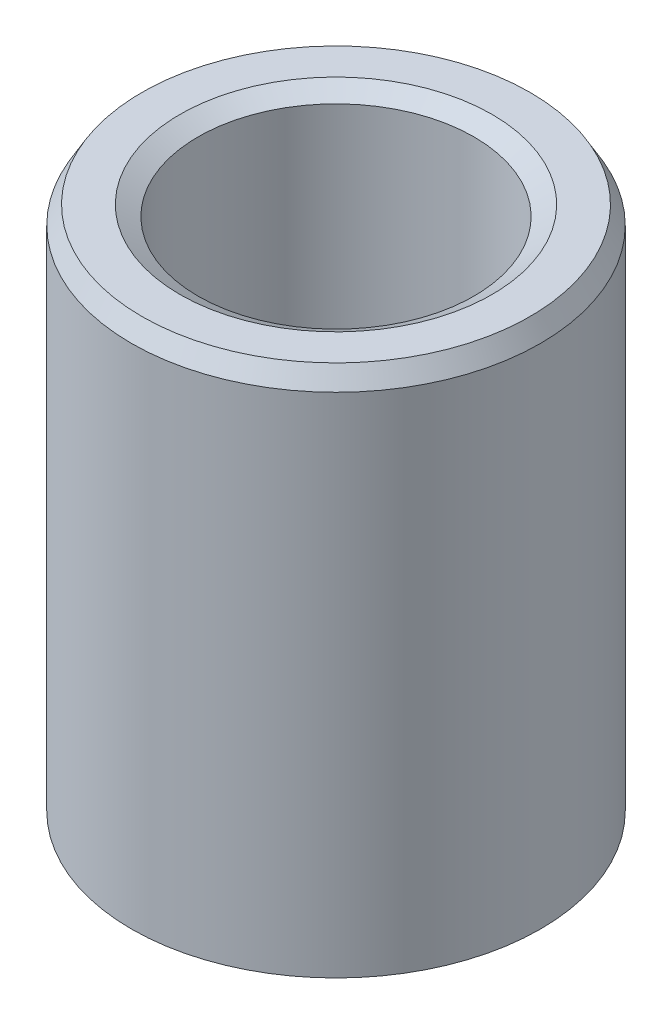
ISO-10303-21;
HEADER;
FILE_DESCRIPTION(('STEP AP214'),'2;1');
FILE_NAME('part.step','',(''),(''),'','','');
FILE_SCHEMA(('AUTOMOTIVE_DESIGN { 1 0 10303 214 1 1 1 1 }'));
ENDSEC;
DATA;
#1=APPLICATION_CONTEXT('core data for automotive mechanical design processes');
#2=APPLICATION_PROTOCOL_DEFINITION('international standard','automotive_design',2000,#1);
#3=PRODUCT_CONTEXT('',#1,'mechanical');
#4=PRODUCT('Part','Part','',(#3));
#5=PRODUCT_RELATED_PRODUCT_CATEGORY('part','',(#4));
#6=PRODUCT_DEFINITION_FORMATION('','',#4);
#7=PRODUCT_DEFINITION_CONTEXT('part definition',#1,'design');
#8=PRODUCT_DEFINITION('design','',#6,#7);
#9=PRODUCT_DEFINITION_SHAPE('','',#8);
#10=(LENGTH_UNIT() NAMED_UNIT(*) SI_UNIT(.MILLI.,.METRE.));
#11=(NAMED_UNIT(*) PLANE_ANGLE_UNIT() SI_UNIT($,.RADIAN.));
#12=(NAMED_UNIT(*) SI_UNIT($,.STERADIAN.) SOLID_ANGLE_UNIT());
#13=UNCERTAINTY_MEASURE_WITH_UNIT(LENGTH_MEASURE(1.E-05),#10,'distance_accuracy_value','');
#14=(GEOMETRIC_REPRESENTATION_CONTEXT(3) GLOBAL_UNCERTAINTY_ASSIGNED_CONTEXT((#13)) GLOBAL_UNIT_ASSIGNED_CONTEXT((#10,
#11,#12)) REPRESENTATION_CONTEXT('',''));
#15=CARTESIAN_POINT('',(0.,0.,0.));
#16=DIRECTION('',(0.,0.,1.));
#17=DIRECTION('',(1.,0.,0.));
#18=AXIS2_PLACEMENT_3D('',#15,#16,#17);
#19=CARTESIAN_POINT('',(0.,45.8368568629976,0.));
#20=DIRECTION('',(0.,-1.,0.));
#21=DIRECTION('',(0.,0.,-1.));
#22=AXIS2_PLACEMENT_3D('',#19,#20,#21);
#23=CYLINDRICAL_SURFACE('',#22,17.5);
#24=CARTESIAN_POINT('',(0.,0.892475041481128,0.));
#25=DIRECTION('',(0.,1.,0.));
#26=DIRECTION('',(0.,0.,1.));
#27=AXIS2_PLACEMENT_3D('',#24,#25,#26);
#28=CIRCLE('',#27,17.5);
#29=CARTESIAN_POINT('',(0.,0.892475041481128,17.5));
#30=VERTEX_POINT('',#29);
#31=EDGE_CURVE('E10',#30,#30,#28,.T.);
#32=ORIENTED_EDGE('',*,*,#31,.T.);
#33=EDGE_LOOP('',(#32));
#34=FACE_BOUND('',#33,.T.);
#35=CARTESIAN_POINT('',(0.,44.2910447466651,0.));
#36=DIRECTION('',(0.,1.,0.));
#37=DIRECTION('',(0.,0.,1.));
#38=AXIS2_PLACEMENT_3D('',#35,#36,#37);
#39=CIRCLE('',#38,17.5);
#40=CARTESIAN_POINT('',(0.,44.2910447466651,17.5));
#41=VERTEX_POINT('',#40);
#42=EDGE_CURVE('E50',#41,#41,#39,.F.);
#43=ORIENTED_EDGE('',*,*,#42,.T.);
#44=EDGE_LOOP('',(#43));
#45=FACE_BOUND('',#44,.T.);
#46=ADVANCED_FACE('F39',(#34,#45),#23,.T.);
#47=CARTESIAN_POINT('',(0.,45.8368568629976,0.));
#48=DIRECTION('',(0.,1.,0.));
#49=DIRECTION('',(0.,0.,1.));
#50=AXIS2_PLACEMENT_3D('',#47,#48,#49);
#51=PLANE('',#50);
#52=CARTESIAN_POINT('',(0.,45.8368568629976,0.));
#53=DIRECTION('',(0.,1.,0.));
#54=DIRECTION('',(0.,0.,1.));
#55=AXIS2_PLACEMENT_3D('',#52,#53,#54);
#56=CIRCLE('',#55,13.352103128803);
#57=CARTESIAN_POINT('',(0.,45.8368568629976,13.352103128803));
#58=VERTEX_POINT('',#57);
#59=EDGE_CURVE('E58',#58,#58,#56,.F.);
#60=ORIENTED_EDGE('',*,*,#59,.T.);
#61=EDGE_LOOP('',(#60));
#62=FACE_BOUND('',#61,.T.);
#63=CARTESIAN_POINT('',(0.,45.8368568629976,0.));
#64=DIRECTION('',(0.,1.,0.));
#65=DIRECTION('',(0.,0.,1.));
#66=AXIS2_PLACEMENT_3D('',#63,#64,#65);
#67=CIRCLE('',#66,16.6075249585189);
#68=CARTESIAN_POINT('',(0.,45.8368568629976,16.6075249585189));
#69=VERTEX_POINT('',#68);
#70=EDGE_CURVE('E61',#69,#69,#67,.T.);
#71=ORIENTED_EDGE('',*,*,#70,.T.);
#72=EDGE_LOOP('',(#71));
#73=FACE_BOUND('',#72,.T.);
#74=ADVANCED_FACE('F88',(#62,#73),#51,.T.);
#75=CARTESIAN_POINT('',(0.,0.,0.));
#76=DIRECTION('',(0.,1.,0.));
#77=DIRECTION('',(0.,0.,1.));
#78=AXIS2_PLACEMENT_3D('',#75,#76,#77);
#79=PLANE('',#78);
#80=CARTESIAN_POINT('',(0.,0.,0.));
#81=DIRECTION('',(0.,1.,0.));
#82=DIRECTION('',(0.,0.,1.));
#83=AXIS2_PLACEMENT_3D('',#80,#81,#82);
#84=CIRCLE('',#83,12.6987660539517);
#85=CARTESIAN_POINT('',(0.,0.,-12.6987660539517));
#86=VERTEX_POINT('',#85);
#87=EDGE_CURVE('E51',#86,#86,#84,.T.);
#88=ORIENTED_EDGE('',*,*,#87,.T.);
#89=EDGE_LOOP('',(#88));
#90=FACE_BOUND('',#89,.T.);
#91=CARTESIAN_POINT('',(0.,0.,0.));
#92=DIRECTION('',(0.,1.,0.));
#93=DIRECTION('',(0.,0.,1.));
#94=AXIS2_PLACEMENT_3D('',#91,#92,#93);
#95=CIRCLE('',#94,15.9541878836675);
#96=CARTESIAN_POINT('',(0.,0.,15.9541878836675));
#97=VERTEX_POINT('',#96);
#98=EDGE_CURVE('E54',#97,#97,#95,.F.);
#99=ORIENTED_EDGE('',*,*,#98,.T.);
#100=EDGE_LOOP('',(#99));
#101=FACE_BOUND('',#100,.T.);
#102=ADVANCED_FACE('F83',(#90,#101),#79,.F.);
#103=CARTESIAN_POINT('',(0.,45.8368568629976,0.));
#104=DIRECTION('',(0.,-1.,0.));
#105=DIRECTION('',(0.,0.,-1.));
#106=AXIS2_PLACEMENT_3D('',#103,#104,#105);
#107=CYLINDRICAL_SURFACE('',#106,11.8062910124706);
#108=CARTESIAN_POINT('',(0.,44.9443818215164,0.));
#109=DIRECTION('',(0.,1.,0.));
#110=DIRECTION('',(0.,0.,1.));
#111=AXIS2_PLACEMENT_3D('',#108,#109,#110);
#112=CIRCLE('',#111,11.8062910124706);
#113=CARTESIAN_POINT('',(0.,44.9443818215164,11.8062910124706));
#114=VERTEX_POINT('',#113);
#115=EDGE_CURVE('E67',#114,#114,#112,.T.);
#116=ORIENTED_EDGE('',*,*,#115,.T.);
#117=EDGE_LOOP('',(#116));
#118=FACE_BOUND('',#117,.T.);
#119=CARTESIAN_POINT('',(0.,1.54581211633247,0.));
#120=DIRECTION('',(0.,1.,0.));
#121=DIRECTION('',(0.,0.,1.));
#122=AXIS2_PLACEMENT_3D('',#119,#120,#121);
#123=CIRCLE('',#122,11.8062910124706);
#124=CARTESIAN_POINT('',(0.,1.54581211633246,-11.8062910124706));
#125=VERTEX_POINT('',#124);
#126=EDGE_CURVE('E69',#125,#125,#123,.F.);
#127=ORIENTED_EDGE('',*,*,#126,.T.);
#128=EDGE_LOOP('',(#127));
#129=FACE_BOUND('',#128,.T.);
#130=ADVANCED_FACE('F71',(#118,#129),#107,.F.);
#131=CARTESIAN_POINT('',(0.,44.9443818215164,0.));
#132=DIRECTION('',(0.,1.,0.));
#133=DIRECTION('',(0.,0.,1.));
#134=AXIS2_PLACEMENT_3D('',#131,#132,#133);
#135=CONICAL_SURFACE('',#134,11.8062910124706,1.0471975511966);
#136=ORIENTED_EDGE('',*,*,#59,.F.);
#137=EDGE_LOOP('',(#136));
#138=FACE_BOUND('',#137,.T.);
#139=ORIENTED_EDGE('',*,*,#115,.F.);
#140=EDGE_LOOP('',(#139));
#141=FACE_BOUND('',#140,.T.);
#142=ADVANCED_FACE('F77',(#138,#141),#135,.F.);
#143=CARTESIAN_POINT('',(0.,0.,0.));
#144=DIRECTION('',(0.,-1.,0.));
#145=DIRECTION('',(0.,0.,-1.));
#146=AXIS2_PLACEMENT_3D('',#143,#144,#145);
#147=CONICAL_SURFACE('',#146,12.6987660539517,0.523598775598297);
#148=CARTESIAN_POINT('',(0.,1.54581211633246,-11.8062910124706));
#149=CARTESIAN_POINT('',(0.,1.52970990678734,-11.815587627486));
#150=CARTESIAN_POINT('',(0.,1.51360769724221,-11.8248842425014));
#151=CARTESIAN_POINT('',(0.,1.48140327815195,-11.8434774725323));
#152=CARTESIAN_POINT('',(0.,1.46530106860682,-11.8527740875477));
#153=CARTESIAN_POINT('',(0.,1.43309664951656,-11.8713673175786));
#154=CARTESIAN_POINT('',(0.,1.41699443997143,-11.880663932594));
#155=CARTESIAN_POINT('',(0.,1.38479002088117,-11.8992571626248));
#156=CARTESIAN_POINT('',(0.,1.36868781133604,-11.9085537776403));
#157=CARTESIAN_POINT('',(0.,1.33648339224578,-11.9271470076711));
#158=CARTESIAN_POINT('',(0.,1.32038118270065,-11.9364436226866));
#159=CARTESIAN_POINT('',(0.,1.28817676361039,-11.9550368527174));
#160=CARTESIAN_POINT('',(0.,1.27207455406526,-11.9643334677328));
#161=CARTESIAN_POINT('',(0.,1.239870134975,-11.9829266977637));
#162=CARTESIAN_POINT('',(0.,1.22376792542987,-11.9922233127791));
#163=CARTESIAN_POINT('',(0.,1.19156350633961,-12.01081654281));
#164=CARTESIAN_POINT('',(0.,1.17546129679448,-12.0201131578254));
#165=CARTESIAN_POINT('',(0.,1.14325687770422,-12.0387063878563));
#166=CARTESIAN_POINT('',(0.,1.12715466815909,-12.0480030028717));
#167=CARTESIAN_POINT('',(0.,1.09495024906883,-12.0665962329026));
#168=CARTESIAN_POINT('',(0.,1.0788480395237,-12.075892847918));
#169=CARTESIAN_POINT('',(0.,1.04664362043344,-12.0944860779488));
#170=CARTESIAN_POINT('',(0.,1.03054141088831,-12.1037826929643));
#171=CARTESIAN_POINT('',(0.,0.99833699179805,-12.1223759229951));
#172=CARTESIAN_POINT('',(0.,0.98223478225292,-12.1316725380105));
#173=CARTESIAN_POINT('',(0.,0.950030363162661,-12.1502657680414));
#174=CARTESIAN_POINT('',(0.,0.933928153617531,-12.1595623830568));
#175=CARTESIAN_POINT('',(0.,0.901723734527271,-12.1781556130877));
#176=CARTESIAN_POINT('',(0.,0.885621524982141,-12.1874522281031));
#177=CARTESIAN_POINT('',(0.,0.853417105891881,-12.206045458134));
#178=CARTESIAN_POINT('',(0.,0.837314896346752,-12.2153420731494));
#179=CARTESIAN_POINT('',(0.,0.805110477256492,-12.2339353031803));
#180=CARTESIAN_POINT('',(0.,0.789008267711362,-12.2432319181957));
#181=CARTESIAN_POINT('',(0.,0.756803848621103,-12.2618251482265));
#182=CARTESIAN_POINT('',(0.,0.740701639075973,-12.271121763242));
#183=CARTESIAN_POINT('',(0.,0.708497219985713,-12.2897149932728));
#184=CARTESIAN_POINT('',(0.,0.692395010440583,-12.2990116082883));
#185=CARTESIAN_POINT('',(0.,0.660190591350324,-12.3176048383191));
#186=CARTESIAN_POINT('',(0.,0.644088381805193,-12.3269014533345));
#187=CARTESIAN_POINT('',(0.,0.611883962714934,-12.3454946833654));
#188=CARTESIAN_POINT('',(0.,0.595781753169804,-12.3547912983808));
#189=CARTESIAN_POINT('',(0.,0.563577334079544,-12.3733845284117));
#190=CARTESIAN_POINT('',(0.,0.547475124534414,-12.3826811434271));
#191=CARTESIAN_POINT('',(0.,0.515270705444155,-12.401274373458));
#192=CARTESIAN_POINT('',(0.,0.499168495899025,-12.4105709884734));
#193=CARTESIAN_POINT('',(0.,0.466964076808766,-12.4291642185043));
#194=CARTESIAN_POINT('',(0.,0.450861867263635,-12.4384608335197));
#195=CARTESIAN_POINT('',(0.,0.418657448173376,-12.4570540635505));
#196=CARTESIAN_POINT('',(0.,0.402555238628246,-12.466350678566));
#197=CARTESIAN_POINT('',(0.,0.370350819537986,-12.4849439085968));
#198=CARTESIAN_POINT('',(0.,0.354248609992856,-12.4942405236123));
#199=CARTESIAN_POINT('',(0.,0.322044190902597,-12.5128337536431));
#200=CARTESIAN_POINT('',(0.,0.305941981357467,-12.5221303686585));
#201=CARTESIAN_POINT('',(0.,0.273737562267207,-12.5407235986894));
#202=CARTESIAN_POINT('',(0.,0.257635352722077,-12.5500202137048));
#203=CARTESIAN_POINT('',(0.,0.225430933631818,-12.5686134437357));
#204=CARTESIAN_POINT('',(0.,0.209328724086688,-12.5779100587511));
#205=CARTESIAN_POINT('',(0.,0.177124304996428,-12.596503288782));
#206=CARTESIAN_POINT('',(0.,0.161022095451298,-12.6057999037974));
#207=CARTESIAN_POINT('',(0.,0.128817676361039,-12.6243931338283));
#208=CARTESIAN_POINT('',(0.,0.112715466815909,-12.6336897488437));
#209=CARTESIAN_POINT('',(0.,0.0805110477256494,-12.6522829788745));
#210=CARTESIAN_POINT('',(0.,0.0644088381805194,-12.66157959389));
#211=CARTESIAN_POINT('',(0.,0.0322044190902594,-12.6801728239208));
#212=CARTESIAN_POINT('',(0.,0.0161022095451294,-12.6894694389363));
#213=CARTESIAN_POINT('',(0.,0.,-12.6987660539517));
#214=B_SPLINE_CURVE_WITH_KNOTS('',3,(#148,#149,#150,#151,#152,#153,#154,#155,#156,#157,#158,
#159,#160,#161,#162,#163,#164,#165,#166,#167,#168,#169,#170,#171,#172,#173,#174,#175,#176,#177,
#178,#179,#180,#181,#182,#183,#184,#185,#186,#187,#188,#189,#190,#191,#192,#193,#194,#195,#196,
#197,#198,#199,#200,#201,#202,#203,#204,#205,#206,#207,#208,#209,#210,#211,#212,#213),
.UNSPECIFIED.,.F.,.F.,(4,2,2,2,2,2,2,2,2,2,2,2,2,2,2,2,2,2,2,2,2,2,2,2,2,2,2,2,2,2,2,2,4),(0.,
0.0557796900925712,0.111559380185142,0.167339070277713,0.223118760370283,0.278898450462854,
0.334678140555425,0.390457830647996,0.446237520740566,0.502017210833137,0.557796900925708,
0.613576591018279,0.669356281110849,0.72513597120342,0.780915661295991,0.836695351388562,
0.892475041481133,0.948254731573704,1.00403442166627,1.05981411175885,1.11559380185142,
1.17137349194399,1.22715318203656,1.28293287212913,1.3387125622217,1.39449225231427,
1.45027194240684,1.50605163249941,1.56183132259198,1.61761101268455,1.67339070277712,
1.72917039286969,1.78495008296226),.UNSPECIFIED.);
#215=EDGE_CURVE('BSEAM73',#125,#86,#214,.T.);
#216=ORIENTED_EDGE('',*,*,#126,.F.);
#217=ORIENTED_EDGE('',*,*,#87,.F.);
#218=ORIENTED_EDGE('',*,*,#215,.T.);
#219=ORIENTED_EDGE('',*,*,#215,.F.);
#220=EDGE_LOOP('',(#216,#218,#217,#219));
#221=FACE_BOUND('',#220,.T.);
#222=ADVANCED_FACE('F73',(#221),#147,.F.);
#223=CARTESIAN_POINT('',(0.,0.892475041481128,0.));
#224=DIRECTION('',(0.,1.,0.));
#225=DIRECTION('',(0.,0.,1.));
#226=AXIS2_PLACEMENT_3D('',#223,#224,#225);
#227=CONICAL_SURFACE('',#226,17.5,1.0471975511966);
#228=CARTESIAN_POINT('',(0.,0.,15.9541878836675));
#229=CARTESIAN_POINT('',(0.,0.00929661501542914,15.9702900932127));
#230=CARTESIAN_POINT('',(0.,0.0185932300308573,15.9863923027578));
#231=CARTESIAN_POINT('',(0.,0.0371864600617135,16.018596721848));
#232=CARTESIAN_POINT('',(0.,0.0464830750771416,16.0346989313932));
#233=CARTESIAN_POINT('',(0.,0.0650763051079986,16.0669033504834));
#234=CARTESIAN_POINT('',(0.,0.0743729201234275,16.0830055600286));
#235=CARTESIAN_POINT('',(0.,0.0929661501542843,16.1152099791188));
#236=CARTESIAN_POINT('',(0.,0.102262765169712,16.131312188664));
#237=CARTESIAN_POINT('',(0.,0.120855995200569,16.1635166077542));
#238=CARTESIAN_POINT('',(0.,0.130152610215998,16.1796188172993));
#239=CARTESIAN_POINT('',(0.,0.148745840246855,16.2118232363896));
#240=CARTESIAN_POINT('',(0.,0.158042455262283,16.2279254459347));
#241=CARTESIAN_POINT('',(0.,0.176635685293139,16.260129865025));
#242=CARTESIAN_POINT('',(0.,0.185932300308568,16.2762320745701));
#243=CARTESIAN_POINT('',(0.,0.204525530339425,16.3084364936604));
#244=CARTESIAN_POINT('',(0.,0.213822145354853,16.3245387032055));
#245=CARTESIAN_POINT('',(0.,0.23241537538571,16.3567431222958));
#246=CARTESIAN_POINT('',(0.,0.241711990401139,16.3728453318409));
#247=CARTESIAN_POINT('',(0.,0.260305220431996,16.4050497509312));
#248=CARTESIAN_POINT('',(0.,0.269601835447424,16.4211519604763));
#249=CARTESIAN_POINT('',(0.,0.28819506547828,16.4533563795666));
#250=CARTESIAN_POINT('',(0.,0.297491680493709,16.4694585891117));
#251=CARTESIAN_POINT('',(0.,0.316084910524566,16.5016630082019));
#252=CARTESIAN_POINT('',(0.,0.325381525539994,16.5177652177471));
#253=CARTESIAN_POINT('',(0.,0.343974755570851,16.5499696368373));
#254=CARTESIAN_POINT('',(0.,0.35327137058628,16.5660718463825));
#255=CARTESIAN_POINT('',(0.,0.371864600617137,16.5982762654727));
#256=CARTESIAN_POINT('',(0.,0.381161215632565,16.6143784750179));
#257=CARTESIAN_POINT('',(0.,0.399754445663422,16.6465828941081));
#258=CARTESIAN_POINT('',(0.,0.40905106067885,16.6626851036532));
#259=CARTESIAN_POINT('',(0.,0.427644290709707,16.6948895227435));
#260=CARTESIAN_POINT('',(0.,0.436940905725136,16.7109917322886));
#261=CARTESIAN_POINT('',(0.,0.455534135755992,16.7431961513789));
#262=CARTESIAN_POINT('',(0.,0.46483075077142,16.759298360924));
#263=CARTESIAN_POINT('',(0.,0.483423980802277,16.7915027800143));
#264=CARTESIAN_POINT('',(0.,0.492720595817706,16.8076049895594));
#265=CARTESIAN_POINT('',(0.,0.511313825848563,16.8398094086497));
#266=CARTESIAN_POINT('',(0.,0.520610440863991,16.8559116181948));
#267=CARTESIAN_POINT('',(0.,0.539203670894848,16.8881160372851));
#268=CARTESIAN_POINT('',(0.,0.548500285910277,16.9042182468302));
#269=CARTESIAN_POINT('',(0.,0.567093515941134,16.9364226659205));
#270=CARTESIAN_POINT('',(0.,0.576390130956561,16.9525248754656));
#271=CARTESIAN_POINT('',(0.,0.594983360987418,16.9847292945558));
#272=CARTESIAN_POINT('',(0.,0.604279976002847,17.000831504101));
#273=CARTESIAN_POINT('',(0.,0.622873206033704,17.0330359231912));
#274=CARTESIAN_POINT('',(0.,0.632169821049132,17.0491381327364));
#275=CARTESIAN_POINT('',(0.,0.650763051079989,17.0813425518266));
#276=CARTESIAN_POINT('',(0.,0.660059666095418,17.0974447613718));
#277=CARTESIAN_POINT('',(0.,0.678652896126275,17.129649180462));
#278=CARTESIAN_POINT('',(0.,0.687949511141702,17.1457513900071));
#279=CARTESIAN_POINT('',(0.,0.706542741172559,17.1779558090974));
#280=CARTESIAN_POINT('',(0.,0.715839356187988,17.1940580186425));
#281=CARTESIAN_POINT('',(0.,0.734432586218845,17.2262624377328));
#282=CARTESIAN_POINT('',(0.,0.743729201234273,17.2423646472779));
#283=CARTESIAN_POINT('',(0.,0.76232243126513,17.2745690663682));
#284=CARTESIAN_POINT('',(0.,0.771619046280559,17.2906712759133));
#285=CARTESIAN_POINT('',(0.,0.790212276311415,17.3228756950036));
#286=CARTESIAN_POINT('',(0.,0.799508891326843,17.3389779045487));
#287=CARTESIAN_POINT('',(0.,0.8181021213577,17.371182323639));
#288=CARTESIAN_POINT('',(0.,0.827398736373129,17.3872845331841));
#289=CARTESIAN_POINT('',(0.,0.845991966403986,17.4194889522744));
#290=CARTESIAN_POINT('',(0.,0.855288581419414,17.4355911618195));
#291=CARTESIAN_POINT('',(0.,0.87388181145027,17.4677955809097));
#292=CARTESIAN_POINT('',(0.,0.883178426465699,17.4838977904549));
#293=CARTESIAN_POINT('',(0.,0.892475041481128,17.5));
#294=B_SPLINE_CURVE_WITH_KNOTS('',3,(#228,#229,#230,#231,#232,#233,#234,#235,#236,#237,#238,
#239,#240,#241,#242,#243,#244,#245,#246,#247,#248,#249,#250,#251,#252,#253,#254,#255,#256,#257,
#258,#259,#260,#261,#262,#263,#264,#265,#266,#267,#268,#269,#270,#271,#272,#273,#274,#275,#276,
#277,#278,#279,#280,#281,#282,#283,#284,#285,#286,#287,#288,#289,#290,#291,#292,#293),
.UNSPECIFIED.,.F.,.F.,(4,2,2,2,2,2,2,2,2,2,2,2,2,2,2,2,2,2,2,2,2,2,2,2,2,2,2,2,2,2,2,2,4),(0.,
0.0557796900925696,0.111559380185142,0.167339070277712,0.223118760370285,0.278898450462854,
0.334678140555427,0.390457830647997,0.446237520740569,0.502017210833139,0.557796900925711,
0.613576591018281,0.669356281110854,0.725135971203423,0.780915661295993,0.836695351388566,
0.892475041481135,0.948254731573708,1.00403442166628,1.05981411175885,1.11559380185142,
1.17137349194399,1.22715318203656,1.28293287212913,1.3387125622217,1.39449225231428,
1.45027194240685,1.50605163249942,1.56183132259199,1.61761101268456,1.67339070277713,
1.7291703928697,1.78495008296227),.UNSPECIFIED.);
#295=EDGE_CURVE('BSEAM76',#97,#30,#294,.T.);
#296=ORIENTED_EDGE('',*,*,#98,.F.);
#297=ORIENTED_EDGE('',*,*,#31,.F.);
#298=ORIENTED_EDGE('',*,*,#295,.T.);
#299=ORIENTED_EDGE('',*,*,#295,.F.);
#300=EDGE_LOOP('',(#296,#298,#297,#299));
#301=FACE_BOUND('',#300,.T.);
#302=ADVANCED_FACE('F76',(#301),#227,.T.);
#303=CARTESIAN_POINT('',(0.,45.8368568629976,0.));
#304=DIRECTION('',(0.,-1.,0.));
#305=DIRECTION('',(0.,0.,-1.));
#306=AXIS2_PLACEMENT_3D('',#303,#304,#305);
#307=CONICAL_SURFACE('',#306,16.6075249585189,0.523598775598292);
#308=ORIENTED_EDGE('',*,*,#42,.F.);
#309=EDGE_LOOP('',(#308));
#310=FACE_BOUND('',#309,.T.);
#311=ORIENTED_EDGE('',*,*,#70,.F.);
#312=EDGE_LOOP('',(#311));
#313=FACE_BOUND('',#312,.T.);
#314=ADVANCED_FACE('F45',(#310,#313),#307,.T.);
#315=CLOSED_SHELL('',(#46,#74,#102,#130,#142,#222,#302,#314));
#316=MANIFOLD_SOLID_BREP('B2',#315);
#317=ADVANCED_BREP_SHAPE_REPRESENTATION('',(#18,#316),#14);
#318=SHAPE_DEFINITION_REPRESENTATION(#9,#317);
ENDSEC;
END-ISO-10303-21;
